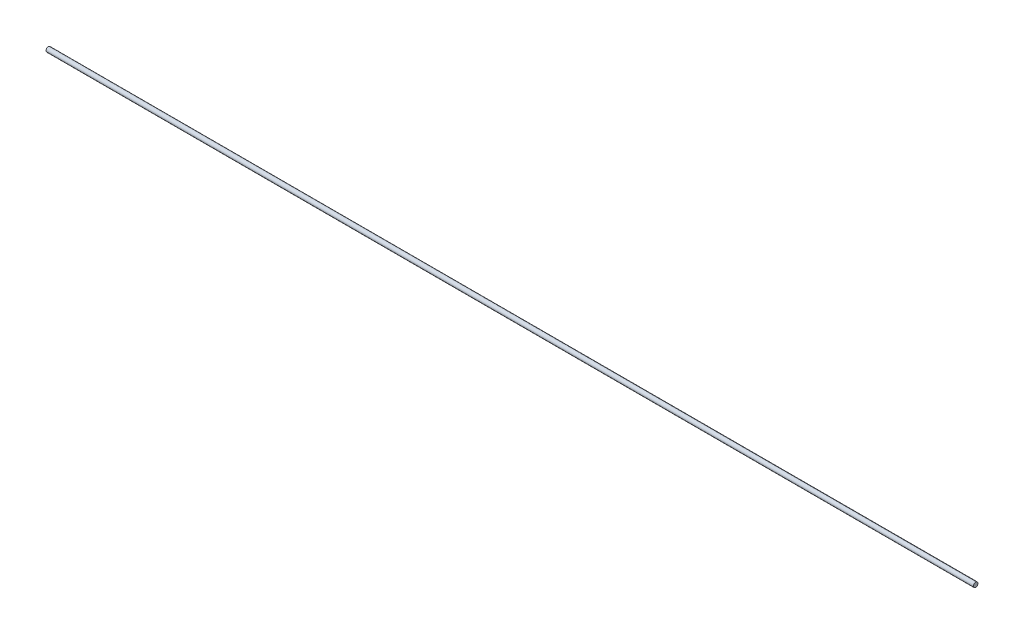
ISO-10303-21;
HEADER;
FILE_DESCRIPTION(('STEP AP214'),'2;1');
FILE_NAME('part.step','',(''),(''),'','','');
FILE_SCHEMA(('AUTOMOTIVE_DESIGN { 1 0 10303 214 1 1 1 1 }'));
ENDSEC;
DATA;
#1=APPLICATION_CONTEXT('core data for automotive mechanical design processes');
#2=APPLICATION_PROTOCOL_DEFINITION('international standard','automotive_design',2000,#1);
#3=PRODUCT_CONTEXT('',#1,'mechanical');
#4=PRODUCT('Part','Part','',(#3));
#5=PRODUCT_RELATED_PRODUCT_CATEGORY('part','',(#4));
#6=PRODUCT_DEFINITION_FORMATION('','',#4);
#7=PRODUCT_DEFINITION_CONTEXT('part definition',#1,'design');
#8=PRODUCT_DEFINITION('design','',#6,#7);
#9=PRODUCT_DEFINITION_SHAPE('','',#8);
#10=(LENGTH_UNIT() NAMED_UNIT(*) SI_UNIT(.MILLI.,.METRE.));
#11=(NAMED_UNIT(*) PLANE_ANGLE_UNIT() SI_UNIT($,.RADIAN.));
#12=(NAMED_UNIT(*) SI_UNIT($,.STERADIAN.) SOLID_ANGLE_UNIT());
#13=UNCERTAINTY_MEASURE_WITH_UNIT(LENGTH_MEASURE(1.E-05),#10,'distance_accuracy_value','');
#14=(GEOMETRIC_REPRESENTATION_CONTEXT(3) GLOBAL_UNCERTAINTY_ASSIGNED_CONTEXT((#13)) GLOBAL_UNIT_ASSIGNED_CONTEXT((#10,
#11,#12)) REPRESENTATION_CONTEXT('',''));
#15=CARTESIAN_POINT('',(0.,0.,0.));
#16=DIRECTION('',(0.,0.,1.));
#17=DIRECTION('',(1.,0.,0.));
#18=AXIS2_PLACEMENT_3D('',#15,#16,#17);
#19=CARTESIAN_POINT('',(1000.,0.,0.));
#20=DIRECTION('',(-1.,0.,0.));
#21=DIRECTION('',(0.,0.,1.));
#22=AXIS2_PLACEMENT_3D('',#19,#20,#21);
#23=CYLINDRICAL_SURFACE('',#22,2.5);
#24=CARTESIAN_POINT('',(1000.,0.,0.));
#25=DIRECTION('',(1.,0.,0.));
#26=DIRECTION('',(0.,0.,-1.));
#27=AXIS2_PLACEMENT_3D('',#24,#25,#26);
#28=CIRCLE('',#27,2.5);
#29=CARTESIAN_POINT('',(1000.,0.,-2.5));
#30=VERTEX_POINT('',#29);
#31=EDGE_CURVE('E10',#30,#30,#28,.T.);
#32=ORIENTED_EDGE('',*,*,#31,.F.);
#33=EDGE_LOOP('',(#32));
#34=FACE_BOUND('',#33,.T.);
#35=CARTESIAN_POINT('',(0.,0.,0.));
#36=DIRECTION('',(1.,0.,0.));
#37=DIRECTION('',(0.,0.,-1.));
#38=AXIS2_PLACEMENT_3D('',#35,#36,#37);
#39=CIRCLE('',#38,2.5);
#40=CARTESIAN_POINT('',(0.,0.,-2.5));
#41=VERTEX_POINT('',#40);
#42=EDGE_CURVE('E36',#41,#41,#39,.T.);
#43=ORIENTED_EDGE('',*,*,#42,.T.);
#44=EDGE_LOOP('',(#43));
#45=FACE_BOUND('',#44,.T.);
#46=ADVANCED_FACE('F33',(#34,#45),#23,.T.);
#47=CARTESIAN_POINT('',(1000.,0.,0.));
#48=DIRECTION('',(1.,0.,0.));
#49=DIRECTION('',(0.,0.,-1.));
#50=AXIS2_PLACEMENT_3D('',#47,#48,#49);
#51=PLANE('',#50);
#52=ORIENTED_EDGE('',*,*,#31,.T.);
#53=EDGE_LOOP('',(#52));
#54=FACE_BOUND('',#53,.T.);
#55=ADVANCED_FACE('F48',(#54),#51,.T.);
#56=CARTESIAN_POINT('',(0.,0.,0.));
#57=DIRECTION('',(1.,0.,0.));
#58=DIRECTION('',(0.,0.,-1.));
#59=AXIS2_PLACEMENT_3D('',#56,#57,#58);
#60=PLANE('',#59);
#61=ORIENTED_EDGE('',*,*,#42,.F.);
#62=EDGE_LOOP('',(#61));
#63=FACE_BOUND('',#62,.T.);
#64=ADVANCED_FACE('F46',(#63),#60,.F.);
#65=CLOSED_SHELL('',(#46,#55,#64));
#66=MANIFOLD_SOLID_BREP('B2',#65);
#67=ADVANCED_BREP_SHAPE_REPRESENTATION('',(#18,#66),#14);
#68=SHAPE_DEFINITION_REPRESENTATION(#9,#67);
ENDSEC;
END-ISO-10303-21;
